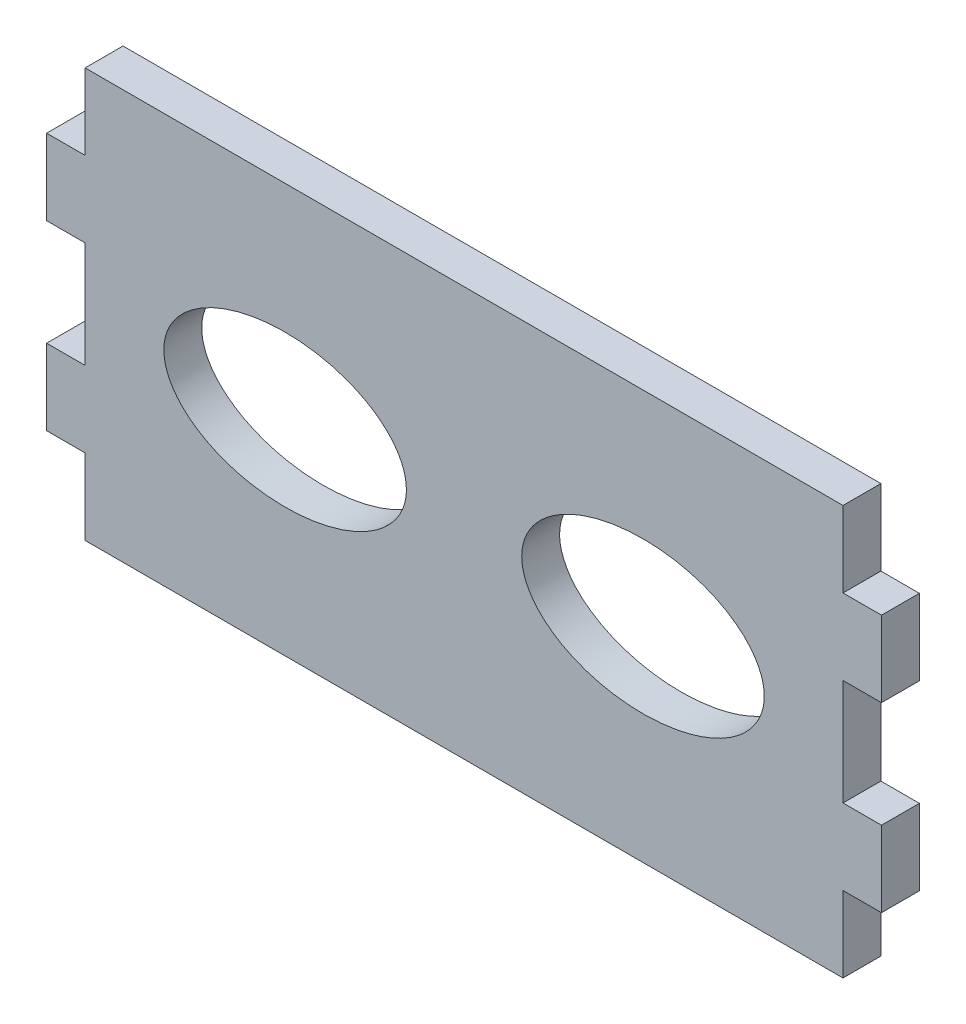
ISO-10303-21;
HEADER;
FILE_DESCRIPTION(('STEP AP214'),'2;1');
FILE_NAME('part.step','',(''),(''),'','','');
FILE_SCHEMA(('AUTOMOTIVE_DESIGN { 1 0 10303 214 1 1 1 1 }'));
ENDSEC;
DATA;
#1=APPLICATION_CONTEXT('core data for automotive mechanical design processes');
#2=APPLICATION_PROTOCOL_DEFINITION('international standard','automotive_design',2000,#1);
#3=PRODUCT_CONTEXT('',#1,'mechanical');
#4=PRODUCT('Part','Part','',(#3));
#5=PRODUCT_RELATED_PRODUCT_CATEGORY('part','',(#4));
#6=PRODUCT_DEFINITION_FORMATION('','',#4);
#7=PRODUCT_DEFINITION_CONTEXT('part definition',#1,'design');
#8=PRODUCT_DEFINITION('design','',#6,#7);
#9=PRODUCT_DEFINITION_SHAPE('','',#8);
#10=(LENGTH_UNIT() NAMED_UNIT(*) SI_UNIT(.MILLI.,.METRE.));
#11=(NAMED_UNIT(*) PLANE_ANGLE_UNIT() SI_UNIT($,.RADIAN.));
#12=(NAMED_UNIT(*) SI_UNIT($,.STERADIAN.) SOLID_ANGLE_UNIT());
#13=UNCERTAINTY_MEASURE_WITH_UNIT(LENGTH_MEASURE(1.E-05),#10,'distance_accuracy_value','');
#14=(GEOMETRIC_REPRESENTATION_CONTEXT(3) GLOBAL_UNCERTAINTY_ASSIGNED_CONTEXT((#13)) GLOBAL_UNIT_ASSIGNED_CONTEXT((#10,
#11,#12)) REPRESENTATION_CONTEXT('',''));
#15=CARTESIAN_POINT('',(0.,0.,0.));
#16=DIRECTION('',(0.,0.,1.));
#17=DIRECTION('',(1.,0.,0.));
#18=AXIS2_PLACEMENT_3D('',#15,#16,#17);
#19=CARTESIAN_POINT('',(31.75,17.145,3.175));
#20=DIRECTION('',(0.,0.,-1.));
#21=DIRECTION('',(-1.,0.,0.));
#22=AXIS2_PLACEMENT_3D('',#19,#20,#21);
#23=PLANE('',#22);
#24=DIRECTION('',(0.,1.,0.));
#25=VECTOR('',#24,1.);
#26=CARTESIAN_POINT('',(31.75,-17.145,3.175));
#27=LINE('',#26,#25);
#28=CARTESIAN_POINT('',(31.75,-17.145,3.175));
#29=VERTEX_POINT('',#28);
#30=CARTESIAN_POINT('',(31.75,-10.795,3.175));
#31=VERTEX_POINT('',#30);
#32=EDGE_CURVE('E334',#29,#31,#27,.T.);
#33=ORIENTED_EDGE('',*,*,#32,.T.);
#34=DIRECTION('',(-1.,0.,0.));
#35=VECTOR('',#34,1.);
#36=CARTESIAN_POINT('',(34.9758,-10.795,3.175));
#37=LINE('',#36,#35);
#38=CARTESIAN_POINT('',(34.9758,-10.795,3.175));
#39=VERTEX_POINT('',#38);
#40=EDGE_CURVE('E205',#39,#31,#37,.T.);
#41=ORIENTED_EDGE('',*,*,#40,.F.);
#42=DIRECTION('',(0.,-1.,0.));
#43=VECTOR('',#42,1.);
#44=CARTESIAN_POINT('',(34.9758,-4.44499999999999,3.175));
#45=LINE('',#44,#43);
#46=CARTESIAN_POINT('',(34.9758,-4.44499999999999,3.175));
#47=VERTEX_POINT('',#46);
#48=EDGE_CURVE('E190',#47,#39,#45,.T.);
#49=ORIENTED_EDGE('',*,*,#48,.F.);
#50=DIRECTION('',(1.,0.,0.));
#51=VECTOR('',#50,1.);
#52=CARTESIAN_POINT('',(31.75,-4.44499999999999,3.175));
#53=LINE('',#52,#51);
#54=CARTESIAN_POINT('',(31.75,-4.44499999999999,3.175));
#55=VERTEX_POINT('',#54);
#56=EDGE_CURVE('E197',#55,#47,#53,.T.);
#57=ORIENTED_EDGE('',*,*,#56,.F.);
#58=CARTESIAN_POINT('',(31.75,4.445,3.175));
#59=VERTEX_POINT('',#58);
#60=EDGE_CURVE('E36',#55,#59,#27,.T.);
#61=ORIENTED_EDGE('',*,*,#60,.T.);
#62=DIRECTION('',(-1.,0.,0.));
#63=VECTOR('',#62,1.);
#64=CARTESIAN_POINT('',(34.9758,4.445,3.175));
#65=LINE('',#64,#63);
#66=CARTESIAN_POINT('',(34.9758,4.445,3.175));
#67=VERTEX_POINT('',#66);
#68=EDGE_CURVE('E211',#67,#59,#65,.T.);
#69=ORIENTED_EDGE('',*,*,#68,.F.);
#70=DIRECTION('',(0.,-1.,0.));
#71=VECTOR('',#70,1.);
#72=CARTESIAN_POINT('',(34.9758,10.795,3.175));
#73=LINE('',#72,#71);
#74=CARTESIAN_POINT('',(34.9758,10.795,3.175));
#75=VERTEX_POINT('',#74);
#76=EDGE_CURVE('E218',#75,#67,#73,.T.);
#77=ORIENTED_EDGE('',*,*,#76,.F.);
#78=DIRECTION('',(1.,0.,0.));
#79=VECTOR('',#78,1.);
#80=CARTESIAN_POINT('',(31.75,10.795,3.175));
#81=LINE('',#80,#79);
#82=CARTESIAN_POINT('',(31.75,10.795,3.175));
#83=VERTEX_POINT('',#82);
#84=EDGE_CURVE('E220',#83,#75,#81,.T.);
#85=ORIENTED_EDGE('',*,*,#84,.F.);
#86=CARTESIAN_POINT('',(31.75,17.145,3.175));
#87=VERTEX_POINT('',#86);
#88=EDGE_CURVE('E277',#83,#87,#27,.T.);
#89=ORIENTED_EDGE('',*,*,#88,.T.);
#90=DIRECTION('',(-1.,0.,0.));
#91=VECTOR('',#90,1.);
#92=CARTESIAN_POINT('',(-31.75,17.145,3.175));
#93=LINE('',#92,#91);
#94=CARTESIAN_POINT('',(-31.75,17.145,3.175));
#95=VERTEX_POINT('',#94);
#96=EDGE_CURVE('E255',#87,#95,#93,.T.);
#97=ORIENTED_EDGE('',*,*,#96,.T.);
#98=DIRECTION('',(0.,-1.,0.));
#99=VECTOR('',#98,1.);
#100=CARTESIAN_POINT('',(-31.75,-17.145,3.175));
#101=LINE('',#100,#99);
#102=CARTESIAN_POINT('',(-31.75,10.795,3.175));
#103=VERTEX_POINT('',#102);
#104=EDGE_CURVE('E265',#95,#103,#101,.T.);
#105=ORIENTED_EDGE('',*,*,#104,.T.);
#106=DIRECTION('',(-1.,0.,0.));
#107=VECTOR('',#106,1.);
#108=CARTESIAN_POINT('',(-31.75,10.795,3.175));
#109=LINE('',#108,#107);
#110=CARTESIAN_POINT('',(-34.9758,10.795,3.175));
#111=VERTEX_POINT('',#110);
#112=EDGE_CURVE('E392',#103,#111,#109,.T.);
#113=ORIENTED_EDGE('',*,*,#112,.T.);
#114=DIRECTION('',(0.,-1.,0.));
#115=VECTOR('',#114,1.);
#116=CARTESIAN_POINT('',(-34.9758,10.795,3.175));
#117=LINE('',#116,#115);
#118=CARTESIAN_POINT('',(-34.9758,4.445,3.175));
#119=VERTEX_POINT('',#118);
#120=EDGE_CURVE('E309',#111,#119,#117,.T.);
#121=ORIENTED_EDGE('',*,*,#120,.T.);
#122=DIRECTION('',(1.,0.,0.));
#123=VECTOR('',#122,1.);
#124=CARTESIAN_POINT('',(-34.9758,4.445,3.175));
#125=LINE('',#124,#123);
#126=CARTESIAN_POINT('',(-31.75,4.445,3.175));
#127=VERTEX_POINT('',#126);
#128=EDGE_CURVE('E304',#119,#127,#125,.T.);
#129=ORIENTED_EDGE('',*,*,#128,.T.);
#130=CARTESIAN_POINT('',(-31.75,-4.44499999999999,3.175));
#131=VERTEX_POINT('',#130);
#132=EDGE_CURVE('E254',#127,#131,#101,.T.);
#133=ORIENTED_EDGE('',*,*,#132,.T.);
#134=DIRECTION('',(-1.,0.,0.));
#135=VECTOR('',#134,1.);
#136=CARTESIAN_POINT('',(-31.75,-4.44499999999999,3.175));
#137=LINE('',#136,#135);
#138=CARTESIAN_POINT('',(-34.9758,-4.44499999999999,3.175));
#139=VERTEX_POINT('',#138);
#140=EDGE_CURVE('E230',#131,#139,#137,.T.);
#141=ORIENTED_EDGE('',*,*,#140,.T.);
#142=DIRECTION('',(0.,-1.,0.));
#143=VECTOR('',#142,1.);
#144=CARTESIAN_POINT('',(-34.9758,-4.44499999999999,3.175));
#145=LINE('',#144,#143);
#146=CARTESIAN_POINT('',(-34.9758,-10.795,3.175));
#147=VERTEX_POINT('',#146);
#148=EDGE_CURVE('E384',#139,#147,#145,.T.);
#149=ORIENTED_EDGE('',*,*,#148,.T.);
#150=DIRECTION('',(1.,0.,0.));
#151=VECTOR('',#150,1.);
#152=CARTESIAN_POINT('',(-34.9758,-10.795,3.175));
#153=LINE('',#152,#151);
#154=CARTESIAN_POINT('',(-31.75,-10.795,3.175));
#155=VERTEX_POINT('',#154);
#156=EDGE_CURVE('E375',#147,#155,#153,.T.);
#157=ORIENTED_EDGE('',*,*,#156,.T.);
#158=CARTESIAN_POINT('',(-31.75,-17.145,3.175));
#159=VERTEX_POINT('',#158);
#160=EDGE_CURVE('E252',#155,#159,#101,.T.);
#161=ORIENTED_EDGE('',*,*,#160,.T.);
#162=DIRECTION('',(1.,0.,0.));
#163=VECTOR('',#162,1.);
#164=CARTESIAN_POINT('',(-31.75,-17.145,3.175));
#165=LINE('',#164,#163);
#166=EDGE_CURVE('E242',#159,#29,#165,.T.);
#167=ORIENTED_EDGE('',*,*,#166,.T.);
#168=EDGE_LOOP('',(#33,#41,#49,#57,#61,#69,#77,#85,#89,#97,#105,#113,#121,#129,#133,#141,#149,
#157,#161,#167));
#169=FACE_BOUND('',#168,.T.);
#170=CARTESIAN_POINT('',(14.9921807241195,0.,3.175));
#171=DIRECTION('',(0.,0.,-1.));
#172=DIRECTION('',(-1.,0.,0.));
#173=AXIS2_PLACEMENT_3D('',#170,#171,#172);
#174=ELLIPSE('',#173,10.16,6.35);
#175=CARTESIAN_POINT('',(4.83218072411951,0.,3.175));
#176=VERTEX_POINT('',#175);
#177=EDGE_CURVE('E201',#176,#176,#174,.T.);
#178=ORIENTED_EDGE('',*,*,#177,.T.);
#179=EDGE_LOOP('',(#178));
#180=FACE_BOUND('',#179,.T.);
#181=CARTESIAN_POINT('',(-14.9921807241195,0.,3.175));
#182=DIRECTION('',(0.,0.,1.));
#183=DIRECTION('',(1.,0.,0.));
#184=AXIS2_PLACEMENT_3D('',#181,#182,#183);
#185=ELLIPSE('',#184,10.16,6.35);
#186=CARTESIAN_POINT('',(-4.83218072411951,0.,3.175));
#187=VERTEX_POINT('',#186);
#188=EDGE_CURVE('E578',#187,#187,#185,.T.);
#189=ORIENTED_EDGE('',*,*,#188,.F.);
#190=EDGE_LOOP('',(#189));
#191=FACE_BOUND('',#190,.T.);
#192=ADVANCED_FACE('F32',(#169,#180,#191),#23,.F.);
#193=CARTESIAN_POINT('',(31.75,17.145,0.));
#194=DIRECTION('',(0.,0.,-1.));
#195=DIRECTION('',(-1.,0.,0.));
#196=AXIS2_PLACEMENT_3D('',#193,#194,#195);
#197=PLANE('',#196);
#198=DIRECTION('',(0.,1.,0.));
#199=VECTOR('',#198,1.);
#200=CARTESIAN_POINT('',(31.75,-17.145,0.));
#201=LINE('',#200,#199);
#202=CARTESIAN_POINT('',(31.75,-17.145,0.));
#203=VERTEX_POINT('',#202);
#204=CARTESIAN_POINT('',(31.75,-10.795,0.));
#205=VERTEX_POINT('',#204);
#206=EDGE_CURVE('E237',#203,#205,#201,.T.);
#207=ORIENTED_EDGE('',*,*,#206,.F.);
#208=DIRECTION('',(1.,0.,0.));
#209=VECTOR('',#208,1.);
#210=CARTESIAN_POINT('',(-31.75,-17.145,0.));
#211=LINE('',#210,#209);
#212=CARTESIAN_POINT('',(-31.75,-17.145,0.));
#213=VERTEX_POINT('',#212);
#214=EDGE_CURVE('E273',#213,#203,#211,.T.);
#215=ORIENTED_EDGE('',*,*,#214,.F.);
#216=DIRECTION('',(0.,-1.,0.));
#217=VECTOR('',#216,1.);
#218=CARTESIAN_POINT('',(-31.75,-17.145,0.));
#219=LINE('',#218,#217);
#220=CARTESIAN_POINT('',(-31.75,-10.795,0.));
#221=VERTEX_POINT('',#220);
#222=EDGE_CURVE('E256',#221,#213,#219,.T.);
#223=ORIENTED_EDGE('',*,*,#222,.F.);
#224=DIRECTION('',(1.,0.,0.));
#225=VECTOR('',#224,1.);
#226=CARTESIAN_POINT('',(-34.9758,-10.795,0.));
#227=LINE('',#226,#225);
#228=CARTESIAN_POINT('',(-34.9758,-10.795,0.));
#229=VERTEX_POINT('',#228);
#230=EDGE_CURVE('E378',#229,#221,#227,.T.);
#231=ORIENTED_EDGE('',*,*,#230,.F.);
#232=DIRECTION('',(0.,-1.,0.));
#233=VECTOR('',#232,1.);
#234=CARTESIAN_POINT('',(-34.9758,-4.44499999999999,0.));
#235=LINE('',#234,#233);
#236=CARTESIAN_POINT('',(-34.9758,-4.44499999999999,0.));
#237=VERTEX_POINT('',#236);
#238=EDGE_CURVE('E374',#237,#229,#235,.T.);
#239=ORIENTED_EDGE('',*,*,#238,.F.);
#240=DIRECTION('',(-1.,0.,0.));
#241=VECTOR('',#240,1.);
#242=CARTESIAN_POINT('',(-31.75,-4.44499999999999,0.));
#243=LINE('',#242,#241);
#244=CARTESIAN_POINT('',(-31.75,-4.44499999999999,0.));
#245=VERTEX_POINT('',#244);
#246=EDGE_CURVE('E371',#245,#237,#243,.T.);
#247=ORIENTED_EDGE('',*,*,#246,.F.);
#248=CARTESIAN_POINT('',(-31.75,4.445,0.));
#249=VERTEX_POINT('',#248);
#250=EDGE_CURVE('E268',#249,#245,#219,.T.);
#251=ORIENTED_EDGE('',*,*,#250,.F.);
#252=DIRECTION('',(1.,0.,0.));
#253=VECTOR('',#252,1.);
#254=CARTESIAN_POINT('',(-34.9758,4.445,0.));
#255=LINE('',#254,#253);
#256=CARTESIAN_POINT('',(-34.9758,4.445,0.));
#257=VERTEX_POINT('',#256);
#258=EDGE_CURVE('E306',#257,#249,#255,.T.);
#259=ORIENTED_EDGE('',*,*,#258,.F.);
#260=DIRECTION('',(0.,-1.,0.));
#261=VECTOR('',#260,1.);
#262=CARTESIAN_POINT('',(-34.9758,10.795,0.));
#263=LINE('',#262,#261);
#264=CARTESIAN_POINT('',(-34.9758,10.795,0.));
#265=VERTEX_POINT('',#264);
#266=EDGE_CURVE('E302',#265,#257,#263,.T.);
#267=ORIENTED_EDGE('',*,*,#266,.F.);
#268=DIRECTION('',(-1.,0.,0.));
#269=VECTOR('',#268,1.);
#270=CARTESIAN_POINT('',(-31.75,10.795,0.));
#271=LINE('',#270,#269);
#272=CARTESIAN_POINT('',(-31.75,10.795,0.));
#273=VERTEX_POINT('',#272);
#274=EDGE_CURVE('E299',#273,#265,#271,.T.);
#275=ORIENTED_EDGE('',*,*,#274,.F.);
#276=CARTESIAN_POINT('',(-31.75,17.145,0.));
#277=VERTEX_POINT('',#276);
#278=EDGE_CURVE('E270',#277,#273,#219,.T.);
#279=ORIENTED_EDGE('',*,*,#278,.F.);
#280=DIRECTION('',(-1.,0.,0.));
#281=VECTOR('',#280,1.);
#282=CARTESIAN_POINT('',(-31.75,17.145,0.));
#283=LINE('',#282,#281);
#284=CARTESIAN_POINT('',(31.75,17.145,0.));
#285=VERTEX_POINT('',#284);
#286=EDGE_CURVE('E244',#285,#277,#283,.T.);
#287=ORIENTED_EDGE('',*,*,#286,.F.);
#288=CARTESIAN_POINT('',(31.75,10.795,0.));
#289=VERTEX_POINT('',#288);
#290=EDGE_CURVE('E238',#289,#285,#201,.T.);
#291=ORIENTED_EDGE('',*,*,#290,.F.);
#292=DIRECTION('',(1.,0.,0.));
#293=VECTOR('',#292,1.);
#294=CARTESIAN_POINT('',(31.75,10.795,0.));
#295=LINE('',#294,#293);
#296=CARTESIAN_POINT('',(34.9758,10.795,0.));
#297=VERTEX_POINT('',#296);
#298=EDGE_CURVE('E216',#289,#297,#295,.T.);
#299=ORIENTED_EDGE('',*,*,#298,.T.);
#300=DIRECTION('',(0.,-1.,0.));
#301=VECTOR('',#300,1.);
#302=CARTESIAN_POINT('',(34.9758,10.795,0.));
#303=LINE('',#302,#301);
#304=CARTESIAN_POINT('',(34.9758,4.445,0.));
#305=VERTEX_POINT('',#304);
#306=EDGE_CURVE('E214',#297,#305,#303,.T.);
#307=ORIENTED_EDGE('',*,*,#306,.T.);
#308=DIRECTION('',(-1.,0.,0.));
#309=VECTOR('',#308,1.);
#310=CARTESIAN_POINT('',(34.9758,4.445,0.));
#311=LINE('',#310,#309);
#312=CARTESIAN_POINT('',(31.75,4.445,0.));
#313=VERTEX_POINT('',#312);
#314=EDGE_CURVE('E217',#305,#313,#311,.T.);
#315=ORIENTED_EDGE('',*,*,#314,.T.);
#316=CARTESIAN_POINT('',(31.75,-4.44499999999999,0.));
#317=VERTEX_POINT('',#316);
#318=EDGE_CURVE('E235',#317,#313,#201,.T.);
#319=ORIENTED_EDGE('',*,*,#318,.F.);
#320=DIRECTION('',(1.,0.,0.));
#321=VECTOR('',#320,1.);
#322=CARTESIAN_POINT('',(31.75,-4.44499999999999,0.));
#323=LINE('',#322,#321);
#324=CARTESIAN_POINT('',(34.9758,-4.44499999999999,0.));
#325=VERTEX_POINT('',#324);
#326=EDGE_CURVE('E181',#317,#325,#323,.T.);
#327=ORIENTED_EDGE('',*,*,#326,.T.);
#328=DIRECTION('',(0.,-1.,0.));
#329=VECTOR('',#328,1.);
#330=CARTESIAN_POINT('',(34.9758,-4.44499999999999,0.));
#331=LINE('',#330,#329);
#332=CARTESIAN_POINT('',(34.9758,-10.795,0.));
#333=VERTEX_POINT('',#332);
#334=EDGE_CURVE('E173',#325,#333,#331,.T.);
#335=ORIENTED_EDGE('',*,*,#334,.T.);
#336=DIRECTION('',(-1.,0.,0.));
#337=VECTOR('',#336,1.);
#338=CARTESIAN_POINT('',(34.9758,-10.795,0.));
#339=LINE('',#338,#337);
#340=EDGE_CURVE('E179',#333,#205,#339,.T.);
#341=ORIENTED_EDGE('',*,*,#340,.T.);
#342=EDGE_LOOP('',(#207,#215,#223,#231,#239,#247,#251,#259,#267,#275,#279,#287,#291,#299,#307,
#315,#319,#327,#335,#341));
#343=FACE_BOUND('',#342,.T.);
#344=CARTESIAN_POINT('',(14.9921807241195,0.,0.));
#345=DIRECTION('',(0.,0.,-1.));
#346=DIRECTION('',(-1.,0.,0.));
#347=AXIS2_PLACEMENT_3D('',#344,#345,#346);
#348=ELLIPSE('',#347,10.16,6.35);
#349=CARTESIAN_POINT('',(4.83218072411951,0.,0.));
#350=VERTEX_POINT('',#349);
#351=EDGE_CURVE('E580',#350,#350,#348,.T.);
#352=ORIENTED_EDGE('',*,*,#351,.F.);
#353=EDGE_LOOP('',(#352));
#354=FACE_BOUND('',#353,.T.);
#355=CARTESIAN_POINT('',(-14.9921807241195,0.,0.));
#356=DIRECTION('',(0.,0.,1.));
#357=DIRECTION('',(1.,0.,0.));
#358=AXIS2_PLACEMENT_3D('',#355,#356,#357);
#359=ELLIPSE('',#358,10.16,6.35);
#360=CARTESIAN_POINT('',(-4.83218072411951,0.,0.));
#361=VERTEX_POINT('',#360);
#362=EDGE_CURVE('E575',#361,#361,#359,.T.);
#363=ORIENTED_EDGE('',*,*,#362,.T.);
#364=EDGE_LOOP('',(#363));
#365=FACE_BOUND('',#364,.T.);
#366=ADVANCED_FACE('F176',(#343,#354,#365),#197,.T.);
#367=CARTESIAN_POINT('',(31.75,-17.145,3.175));
#368=DIRECTION('',(-1.,0.,0.));
#369=DIRECTION('',(0.,0.,1.));
#370=AXIS2_PLACEMENT_3D('',#367,#368,#369);
#371=PLANE('',#370);
#372=DIRECTION('',(0.,0.,1.));
#373=VECTOR('',#372,1.);
#374=CARTESIAN_POINT('',(31.75,-4.44499999999999,0.));
#375=LINE('',#374,#373);
#376=EDGE_CURVE('E208',#317,#55,#375,.T.);
#377=ORIENTED_EDGE('',*,*,#376,.F.);
#378=ORIENTED_EDGE('',*,*,#318,.T.);
#379=DIRECTION('',(0.,0.,1.));
#380=VECTOR('',#379,1.);
#381=CARTESIAN_POINT('',(31.75,4.445,0.));
#382=LINE('',#381,#380);
#383=EDGE_CURVE('E351',#313,#59,#382,.T.);
#384=ORIENTED_EDGE('',*,*,#383,.T.);
#385=ORIENTED_EDGE('',*,*,#60,.F.);
#386=EDGE_LOOP('',(#377,#378,#384,#385));
#387=FACE_BOUND('',#386,.T.);
#388=ADVANCED_FACE('F34',(#387),#371,.F.);
#389=DIRECTION('',(0.,0.,1.));
#390=VECTOR('',#389,1.);
#391=CARTESIAN_POINT('',(31.75,-10.795,0.));
#392=LINE('',#391,#390);
#393=EDGE_CURVE('E57',#205,#31,#392,.T.);
#394=ORIENTED_EDGE('',*,*,#393,.T.);
#395=ORIENTED_EDGE('',*,*,#32,.F.);
#396=DIRECTION('',(0.,0.,-1.));
#397=VECTOR('',#396,1.);
#398=CARTESIAN_POINT('',(31.75,-17.145,3.175));
#399=LINE('',#398,#397);
#400=EDGE_CURVE('E278',#29,#203,#399,.T.);
#401=ORIENTED_EDGE('',*,*,#400,.T.);
#402=ORIENTED_EDGE('',*,*,#206,.T.);
#403=EDGE_LOOP('',(#394,#395,#401,#402));
#404=FACE_BOUND('',#403,.T.);
#405=ADVANCED_FACE('F427',(#404),#371,.F.);
#406=DIRECTION('',(0.,0.,1.));
#407=VECTOR('',#406,1.);
#408=CARTESIAN_POINT('',(31.75,10.795,0.));
#409=LINE('',#408,#407);
#410=EDGE_CURVE('E226',#289,#83,#409,.T.);
#411=ORIENTED_EDGE('',*,*,#410,.F.);
#412=ORIENTED_EDGE('',*,*,#290,.T.);
#413=DIRECTION('',(0.,0.,-1.));
#414=VECTOR('',#413,1.);
#415=CARTESIAN_POINT('',(31.75,17.145,3.175));
#416=LINE('',#415,#414);
#417=EDGE_CURVE('E11',#87,#285,#416,.T.);
#418=ORIENTED_EDGE('',*,*,#417,.F.);
#419=ORIENTED_EDGE('',*,*,#88,.F.);
#420=EDGE_LOOP('',(#411,#412,#418,#419));
#421=FACE_BOUND('',#420,.T.);
#422=ADVANCED_FACE('F345',(#421),#371,.F.);
#423=CARTESIAN_POINT('',(-31.75,-17.145,3.175));
#424=DIRECTION('',(1.,0.,0.));
#425=DIRECTION('',(0.,0.,-1.));
#426=AXIS2_PLACEMENT_3D('',#423,#424,#425);
#427=PLANE('',#426);
#428=ORIENTED_EDGE('',*,*,#160,.F.);
#429=DIRECTION('',(0.,0.,1.));
#430=VECTOR('',#429,1.);
#431=CARTESIAN_POINT('',(-31.75,-10.795,0.));
#432=LINE('',#431,#430);
#433=EDGE_CURVE('E389',#221,#155,#432,.T.);
#434=ORIENTED_EDGE('',*,*,#433,.F.);
#435=ORIENTED_EDGE('',*,*,#222,.T.);
#436=DIRECTION('',(0.,0.,-1.));
#437=VECTOR('',#436,1.);
#438=CARTESIAN_POINT('',(-31.75,-17.145,3.175));
#439=LINE('',#438,#437);
#440=EDGE_CURVE('E281',#159,#213,#439,.T.);
#441=ORIENTED_EDGE('',*,*,#440,.F.);
#442=EDGE_LOOP('',(#428,#434,#435,#441));
#443=FACE_BOUND('',#442,.T.);
#444=ADVANCED_FACE('F420',(#443),#427,.F.);
#445=ORIENTED_EDGE('',*,*,#250,.T.);
#446=DIRECTION('',(0.,0.,1.));
#447=VECTOR('',#446,1.);
#448=CARTESIAN_POINT('',(-31.75,-4.44499999999999,0.));
#449=LINE('',#448,#447);
#450=EDGE_CURVE('E381',#245,#131,#449,.T.);
#451=ORIENTED_EDGE('',*,*,#450,.T.);
#452=ORIENTED_EDGE('',*,*,#132,.F.);
#453=DIRECTION('',(0.,0.,1.));
#454=VECTOR('',#453,1.);
#455=CARTESIAN_POINT('',(-31.75,4.445,0.));
#456=LINE('',#455,#454);
#457=EDGE_CURVE('E318',#249,#127,#456,.T.);
#458=ORIENTED_EDGE('',*,*,#457,.F.);
#459=EDGE_LOOP('',(#445,#451,#452,#458));
#460=FACE_BOUND('',#459,.T.);
#461=ADVANCED_FACE('F401',(#460),#427,.F.);
#462=CARTESIAN_POINT('',(-31.75,17.145,3.175));
#463=DIRECTION('',(0.,-1.,0.));
#464=DIRECTION('',(0.,0.,-1.));
#465=AXIS2_PLACEMENT_3D('',#462,#463,#464);
#466=PLANE('',#465);
#467=ORIENTED_EDGE('',*,*,#286,.T.);
#468=DIRECTION('',(0.,0.,-1.));
#469=VECTOR('',#468,1.);
#470=CARTESIAN_POINT('',(-31.75,17.145,3.175));
#471=LINE('',#470,#469);
#472=EDGE_CURVE('E42',#95,#277,#471,.T.);
#473=ORIENTED_EDGE('',*,*,#472,.F.);
#474=ORIENTED_EDGE('',*,*,#96,.F.);
#475=ORIENTED_EDGE('',*,*,#417,.T.);
#476=EDGE_LOOP('',(#467,#473,#474,#475));
#477=FACE_BOUND('',#476,.T.);
#478=ADVANCED_FACE('F344',(#477),#466,.F.);
#479=ORIENTED_EDGE('',*,*,#278,.T.);
#480=DIRECTION('',(0.,0.,1.));
#481=VECTOR('',#480,1.);
#482=CARTESIAN_POINT('',(-31.75,10.795,0.));
#483=LINE('',#482,#481);
#484=EDGE_CURVE('E313',#273,#103,#483,.T.);
#485=ORIENTED_EDGE('',*,*,#484,.T.);
#486=ORIENTED_EDGE('',*,*,#104,.F.);
#487=ORIENTED_EDGE('',*,*,#472,.T.);
#488=EDGE_LOOP('',(#479,#485,#486,#487));
#489=FACE_BOUND('',#488,.T.);
#490=ADVANCED_FACE('F290',(#489),#427,.F.);
#491=CARTESIAN_POINT('',(-31.75,-17.145,3.175));
#492=DIRECTION('',(0.,1.,0.));
#493=DIRECTION('',(0.,0.,1.));
#494=AXIS2_PLACEMENT_3D('',#491,#492,#493);
#495=PLANE('',#494);
#496=ORIENTED_EDGE('',*,*,#214,.T.);
#497=ORIENTED_EDGE('',*,*,#400,.F.);
#498=ORIENTED_EDGE('',*,*,#166,.F.);
#499=ORIENTED_EDGE('',*,*,#440,.T.);
#500=EDGE_LOOP('',(#496,#497,#498,#499));
#501=FACE_BOUND('',#500,.T.);
#502=ADVANCED_FACE('F425',(#501),#495,.F.);
#503=CARTESIAN_POINT('',(-34.9758,4.445,0.));
#504=DIRECTION('',(0.,-1.,0.));
#505=DIRECTION('',(0.,0.,-1.));
#506=AXIS2_PLACEMENT_3D('',#503,#504,#505);
#507=PLANE('',#506);
#508=ORIENTED_EDGE('',*,*,#128,.F.);
#509=DIRECTION('',(0.,0.,1.));
#510=VECTOR('',#509,1.);
#511=CARTESIAN_POINT('',(-34.9758,4.445,0.));
#512=LINE('',#511,#510);
#513=EDGE_CURVE('E321',#257,#119,#512,.T.);
#514=ORIENTED_EDGE('',*,*,#513,.F.);
#515=ORIENTED_EDGE('',*,*,#258,.T.);
#516=ORIENTED_EDGE('',*,*,#457,.T.);
#517=EDGE_LOOP('',(#508,#514,#515,#516));
#518=FACE_BOUND('',#517,.T.);
#519=ADVANCED_FACE('F446',(#518),#507,.T.);
#520=CARTESIAN_POINT('',(-34.9758,10.795,0.));
#521=DIRECTION('',(-1.,0.,0.));
#522=DIRECTION('',(0.,0.,1.));
#523=AXIS2_PLACEMENT_3D('',#520,#521,#522);
#524=PLANE('',#523);
#525=ORIENTED_EDGE('',*,*,#120,.F.);
#526=DIRECTION('',(0.,0.,1.));
#527=VECTOR('',#526,1.);
#528=CARTESIAN_POINT('',(-34.9758,10.795,0.));
#529=LINE('',#528,#527);
#530=EDGE_CURVE('E327',#265,#111,#529,.T.);
#531=ORIENTED_EDGE('',*,*,#530,.F.);
#532=ORIENTED_EDGE('',*,*,#266,.T.);
#533=ORIENTED_EDGE('',*,*,#513,.T.);
#534=EDGE_LOOP('',(#525,#531,#532,#533));
#535=FACE_BOUND('',#534,.T.);
#536=ADVANCED_FACE('F597',(#535),#524,.T.);
#537=CARTESIAN_POINT('',(-31.75,10.795,0.));
#538=DIRECTION('',(0.,1.,0.));
#539=DIRECTION('',(-1.,0.,0.));
#540=AXIS2_PLACEMENT_3D('',#537,#538,#539);
#541=PLANE('',#540);
#542=ORIENTED_EDGE('',*,*,#112,.F.);
#543=ORIENTED_EDGE('',*,*,#484,.F.);
#544=ORIENTED_EDGE('',*,*,#274,.T.);
#545=ORIENTED_EDGE('',*,*,#530,.T.);
#546=EDGE_LOOP('',(#542,#543,#544,#545));
#547=FACE_BOUND('',#546,.T.);
#548=ADVANCED_FACE('F441',(#547),#541,.T.);
#549=CARTESIAN_POINT('',(-34.9758,-10.795,0.));
#550=DIRECTION('',(0.,-1.,0.));
#551=DIRECTION('',(1.,0.,0.));
#552=AXIS2_PLACEMENT_3D('',#549,#550,#551);
#553=PLANE('',#552);
#554=ORIENTED_EDGE('',*,*,#156,.F.);
#555=DIRECTION('',(0.,0.,1.));
#556=VECTOR('',#555,1.);
#557=CARTESIAN_POINT('',(-34.9758,-10.795,0.));
#558=LINE('',#557,#556);
#559=EDGE_CURVE('E393',#229,#147,#558,.T.);
#560=ORIENTED_EDGE('',*,*,#559,.F.);
#561=ORIENTED_EDGE('',*,*,#230,.T.);
#562=ORIENTED_EDGE('',*,*,#433,.T.);
#563=EDGE_LOOP('',(#554,#560,#561,#562));
#564=FACE_BOUND('',#563,.T.);
#565=ADVANCED_FACE('F416',(#564),#553,.T.);
#566=CARTESIAN_POINT('',(-34.9758,-4.44499999999999,0.));
#567=DIRECTION('',(-1.,0.,0.));
#568=DIRECTION('',(0.,0.,1.));
#569=AXIS2_PLACEMENT_3D('',#566,#567,#568);
#570=PLANE('',#569);
#571=ORIENTED_EDGE('',*,*,#148,.F.);
#572=DIRECTION('',(0.,0.,1.));
#573=VECTOR('',#572,1.);
#574=CARTESIAN_POINT('',(-34.9758,-4.44499999999999,0.));
#575=LINE('',#574,#573);
#576=EDGE_CURVE('E395',#237,#139,#575,.T.);
#577=ORIENTED_EDGE('',*,*,#576,.F.);
#578=ORIENTED_EDGE('',*,*,#238,.T.);
#579=ORIENTED_EDGE('',*,*,#559,.T.);
#580=EDGE_LOOP('',(#571,#577,#578,#579));
#581=FACE_BOUND('',#580,.T.);
#582=ADVANCED_FACE('F413',(#581),#570,.T.);
#583=CARTESIAN_POINT('',(-31.75,-4.44499999999999,0.));
#584=DIRECTION('',(0.,1.,0.));
#585=DIRECTION('',(0.,0.,1.));
#586=AXIS2_PLACEMENT_3D('',#583,#584,#585);
#587=PLANE('',#586);
#588=ORIENTED_EDGE('',*,*,#140,.F.);
#589=ORIENTED_EDGE('',*,*,#450,.F.);
#590=ORIENTED_EDGE('',*,*,#246,.T.);
#591=ORIENTED_EDGE('',*,*,#576,.T.);
#592=EDGE_LOOP('',(#588,#589,#590,#591));
#593=FACE_BOUND('',#592,.T.);
#594=ADVANCED_FACE('F409',(#593),#587,.T.);
#595=CARTESIAN_POINT('',(31.75,10.795,0.));
#596=DIRECTION('',(0.,-1.,0.));
#597=DIRECTION('',(1.,0.,0.));
#598=AXIS2_PLACEMENT_3D('',#595,#596,#597);
#599=PLANE('',#598);
#600=ORIENTED_EDGE('',*,*,#84,.T.);
#601=DIRECTION('',(0.,0.,1.));
#602=VECTOR('',#601,1.);
#603=CARTESIAN_POINT('',(34.9758,10.795,0.));
#604=LINE('',#603,#602);
#605=EDGE_CURVE('E223',#297,#75,#604,.T.);
#606=ORIENTED_EDGE('',*,*,#605,.F.);
#607=ORIENTED_EDGE('',*,*,#298,.F.);
#608=ORIENTED_EDGE('',*,*,#410,.T.);
#609=EDGE_LOOP('',(#600,#606,#607,#608));
#610=FACE_BOUND('',#609,.T.);
#611=ADVANCED_FACE('F353',(#610),#599,.F.);
#612=CARTESIAN_POINT('',(34.9758,10.795,0.));
#613=DIRECTION('',(-1.,0.,0.));
#614=DIRECTION('',(0.,0.,1.));
#615=AXIS2_PLACEMENT_3D('',#612,#613,#614);
#616=PLANE('',#615);
#617=ORIENTED_EDGE('',*,*,#76,.T.);
#618=DIRECTION('',(0.,0.,1.));
#619=VECTOR('',#618,1.);
#620=CARTESIAN_POINT('',(34.9758,4.445,0.));
#621=LINE('',#620,#619);
#622=EDGE_CURVE('E355',#305,#67,#621,.T.);
#623=ORIENTED_EDGE('',*,*,#622,.F.);
#624=ORIENTED_EDGE('',*,*,#306,.F.);
#625=ORIENTED_EDGE('',*,*,#605,.T.);
#626=EDGE_LOOP('',(#617,#623,#624,#625));
#627=FACE_BOUND('',#626,.T.);
#628=ADVANCED_FACE('F356',(#627),#616,.F.);
#629=CARTESIAN_POINT('',(34.9758,4.445,0.));
#630=DIRECTION('',(0.,1.,0.));
#631=DIRECTION('',(0.,0.,1.));
#632=AXIS2_PLACEMENT_3D('',#629,#630,#631);
#633=PLANE('',#632);
#634=ORIENTED_EDGE('',*,*,#68,.T.);
#635=ORIENTED_EDGE('',*,*,#383,.F.);
#636=ORIENTED_EDGE('',*,*,#314,.F.);
#637=ORIENTED_EDGE('',*,*,#622,.T.);
#638=EDGE_LOOP('',(#634,#635,#636,#637));
#639=FACE_BOUND('',#638,.T.);
#640=ADVANCED_FACE('F361',(#639),#633,.F.);
#641=CARTESIAN_POINT('',(31.75,-4.44499999999999,0.));
#642=DIRECTION('',(0.,-1.,0.));
#643=DIRECTION('',(0.,0.,-1.));
#644=AXIS2_PLACEMENT_3D('',#641,#642,#643);
#645=PLANE('',#644);
#646=ORIENTED_EDGE('',*,*,#56,.T.);
#647=DIRECTION('',(0.,0.,1.));
#648=VECTOR('',#647,1.);
#649=CARTESIAN_POINT('',(34.9758,-4.44499999999999,0.));
#650=LINE('',#649,#648);
#651=EDGE_CURVE('E194',#325,#47,#650,.T.);
#652=ORIENTED_EDGE('',*,*,#651,.F.);
#653=ORIENTED_EDGE('',*,*,#326,.F.);
#654=ORIENTED_EDGE('',*,*,#376,.T.);
#655=EDGE_LOOP('',(#646,#652,#653,#654));
#656=FACE_BOUND('',#655,.T.);
#657=ADVANCED_FACE('F493',(#656),#645,.F.);
#658=CARTESIAN_POINT('',(34.9758,-4.44499999999999,0.));
#659=DIRECTION('',(-1.,0.,0.));
#660=DIRECTION('',(0.,0.,1.));
#661=AXIS2_PLACEMENT_3D('',#658,#659,#660);
#662=PLANE('',#661);
#663=ORIENTED_EDGE('',*,*,#48,.T.);
#664=DIRECTION('',(0.,0.,1.));
#665=VECTOR('',#664,1.);
#666=CARTESIAN_POINT('',(34.9758,-10.795,0.));
#667=LINE('',#666,#665);
#668=EDGE_CURVE('E187',#333,#39,#667,.T.);
#669=ORIENTED_EDGE('',*,*,#668,.F.);
#670=ORIENTED_EDGE('',*,*,#334,.F.);
#671=ORIENTED_EDGE('',*,*,#651,.T.);
#672=EDGE_LOOP('',(#663,#669,#670,#671));
#673=FACE_BOUND('',#672,.T.);
#674=ADVANCED_FACE('F188',(#673),#662,.F.);
#675=CARTESIAN_POINT('',(34.9758,-10.795,0.));
#676=DIRECTION('',(0.,1.,0.));
#677=DIRECTION('',(-1.,0.,0.));
#678=AXIS2_PLACEMENT_3D('',#675,#676,#677);
#679=PLANE('',#678);
#680=ORIENTED_EDGE('',*,*,#40,.T.);
#681=ORIENTED_EDGE('',*,*,#393,.F.);
#682=ORIENTED_EDGE('',*,*,#340,.F.);
#683=ORIENTED_EDGE('',*,*,#668,.T.);
#684=EDGE_LOOP('',(#680,#681,#682,#683));
#685=FACE_BOUND('',#684,.T.);
#686=ADVANCED_FACE('F196',(#685),#679,.F.);
#687=CARTESIAN_POINT('',(14.9921807241195,0.,3.17505));
#688=DIRECTION('',(0.,0.,-1.));
#689=DIRECTION('',(-1.,0.,0.));
#690=AXIS2_PLACEMENT_3D('',#687,#688,#689);
#691=ELLIPSE('',#690,10.16,6.35);
#692=DIRECTION('',(0.,0.,-1.));
#693=VECTOR('',#692,1.);
#694=SURFACE_OF_LINEAR_EXTRUSION('',#691,#693);
#695=ORIENTED_EDGE('',*,*,#351,.T.);
#696=EDGE_LOOP('',(#695));
#697=FACE_BOUND('',#696,.T.);
#698=ORIENTED_EDGE('',*,*,#177,.F.);
#699=EDGE_LOOP('',(#698));
#700=FACE_BOUND('',#699,.T.);
#701=ADVANCED_FACE('F518',(#697,#700),#694,.F.);
#702=CARTESIAN_POINT('',(-14.9921807241195,0.,3.17505));
#703=DIRECTION('',(0.,0.,1.));
#704=DIRECTION('',(1.,0.,0.));
#705=AXIS2_PLACEMENT_3D('',#702,#703,#704);
#706=ELLIPSE('',#705,10.16,6.35);
#707=DIRECTION('',(0.,0.,-1.));
#708=VECTOR('',#707,1.);
#709=SURFACE_OF_LINEAR_EXTRUSION('',#706,#708);
#710=ORIENTED_EDGE('',*,*,#362,.F.);
#711=EDGE_LOOP('',(#710));
#712=FACE_BOUND('',#711,.T.);
#713=ORIENTED_EDGE('',*,*,#188,.T.);
#714=EDGE_LOOP('',(#713));
#715=FACE_BOUND('',#714,.T.);
#716=ADVANCED_FACE('F527',(#712,#715),#709,.T.);
#717=CLOSED_SHELL('',(#192,#366,#388,#405,#422,#444,#461,#478,#490,#502,#519,#536,#548,#565,
#582,#594,#611,#628,#640,#657,#674,#686,#701,#716));
#718=MANIFOLD_SOLID_BREP('B2',#717);
#719=ADVANCED_BREP_SHAPE_REPRESENTATION('',(#18,#718),#14);
#720=SHAPE_DEFINITION_REPRESENTATION(#9,#719);
ENDSEC;
END-ISO-10303-21;
